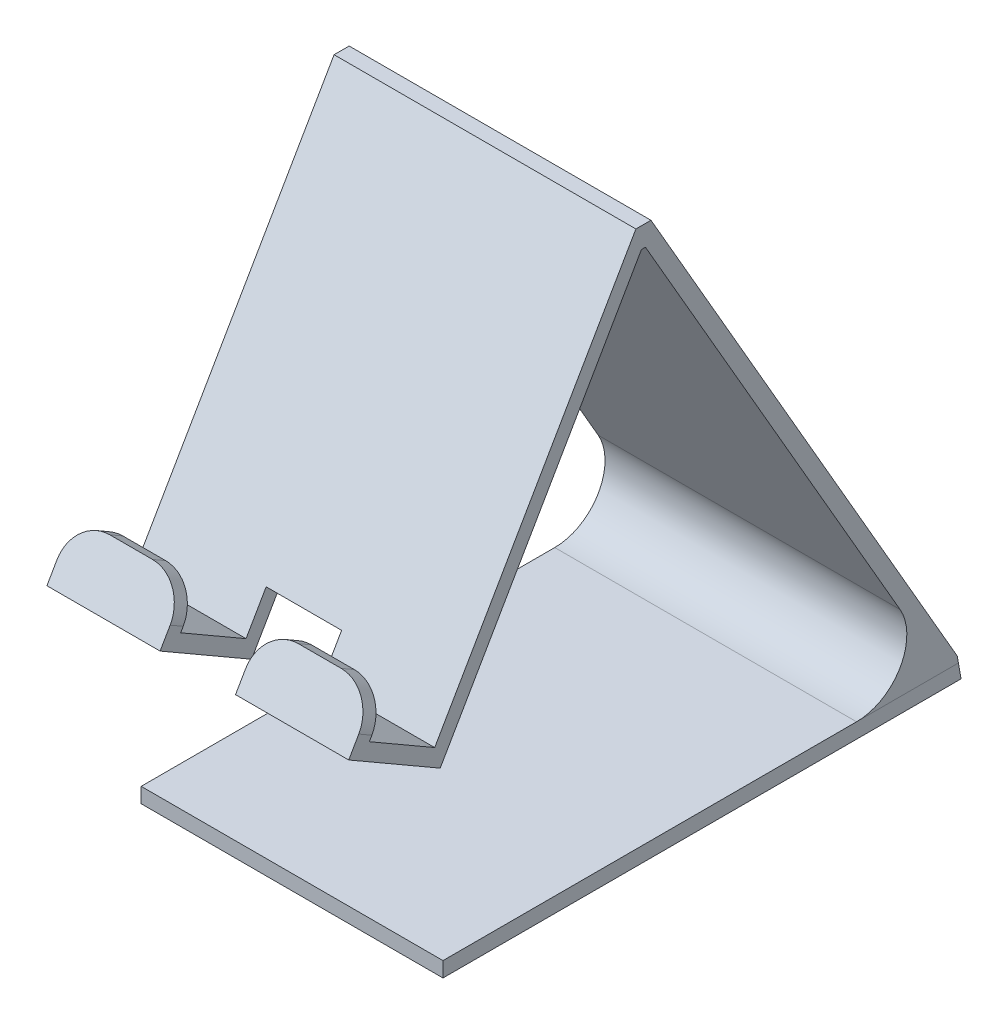
ISO-10303-21;
HEADER;
FILE_DESCRIPTION(('STEP AP214'),'2;1');
FILE_NAME('part.step','',(''),(''),'','','');
FILE_SCHEMA(('AUTOMOTIVE_DESIGN { 1 0 10303 214 1 1 1 1 }'));
ENDSEC;
DATA;
#1=APPLICATION_CONTEXT('core data for automotive mechanical design processes');
#2=APPLICATION_PROTOCOL_DEFINITION('international standard','automotive_design',2000,#1);
#3=PRODUCT_CONTEXT('',#1,'mechanical');
#4=PRODUCT('Part','Part','',(#3));
#5=PRODUCT_RELATED_PRODUCT_CATEGORY('part','',(#4));
#6=PRODUCT_DEFINITION_FORMATION('','',#4);
#7=PRODUCT_DEFINITION_CONTEXT('part definition',#1,'design');
#8=PRODUCT_DEFINITION('design','',#6,#7);
#9=PRODUCT_DEFINITION_SHAPE('','',#8);
#10=(LENGTH_UNIT() NAMED_UNIT(*) SI_UNIT(.MILLI.,.METRE.));
#11=(NAMED_UNIT(*) PLANE_ANGLE_UNIT() SI_UNIT($,.RADIAN.));
#12=(NAMED_UNIT(*) SI_UNIT($,.STERADIAN.) SOLID_ANGLE_UNIT());
#13=UNCERTAINTY_MEASURE_WITH_UNIT(LENGTH_MEASURE(1.E-05),#10,'distance_accuracy_value','');
#14=(GEOMETRIC_REPRESENTATION_CONTEXT(3) GLOBAL_UNCERTAINTY_ASSIGNED_CONTEXT((#13)) GLOBAL_UNIT_ASSIGNED_CONTEXT((#10,
#11,#12)) REPRESENTATION_CONTEXT('',''));
#15=CARTESIAN_POINT('',(0.,0.,0.));
#16=DIRECTION('',(0.,0.,1.));
#17=DIRECTION('',(1.,0.,0.));
#18=AXIS2_PLACEMENT_3D('',#15,#16,#17);
#19=CARTESIAN_POINT('',(-30.,49.5019123998392,68.7401964872934));
#20=DIRECTION('',(0.,0.866025403784394,-0.500000000000077));
#21=DIRECTION('',(0.,0.500000000000078,0.866025403784394));
#22=AXIS2_PLACEMENT_3D('',#19,#20,#21);
#23=PLANE('',#22);
#24=DIRECTION('',(0.,-0.500000000000077,-0.866025403784394));
#25=VECTOR('',#24,1.);
#26=CARTESIAN_POINT('',(7.5,49.5019123998392,68.7401964872934));
#27=LINE('',#26,#25);
#28=CARTESIAN_POINT('',(7.5,48.001912399839,66.1421202759403));
#29=VERTEX_POINT('',#28);
#30=CARTESIAN_POINT('',(7.50000000000002,40.5019123998389,53.1517392191735));
#31=VERTEX_POINT('',#30);
#32=EDGE_CURVE('E350',#29,#31,#27,.T.);
#33=ORIENTED_EDGE('',*,*,#32,.F.);
#34=DIRECTION('',(1.,0.,0.));
#35=VECTOR('',#34,1.);
#36=CARTESIAN_POINT('',(7.50000000000002,48.0019123998392,66.1421202759401));
#37=LINE('',#36,#35);
#38=CARTESIAN_POINT('',(30.,48.0019123998389,66.1421202759403));
#39=VERTEX_POINT('',#38);
#40=EDGE_CURVE('E341',#29,#39,#37,.T.);
#41=ORIENTED_EDGE('',*,*,#40,.T.);
#42=DIRECTION('',(0.,0.500000000000077,0.866025403784394));
#43=VECTOR('',#42,1.);
#44=CARTESIAN_POINT('',(30.,49.5019123998392,68.7401964872934));
#45=LINE('',#44,#43);
#46=CARTESIAN_POINT('',(30.,40.5019123998389,53.1517392191735));
#47=VERTEX_POINT('',#46);
#48=EDGE_CURVE('E394',#47,#39,#45,.T.);
#49=ORIENTED_EDGE('',*,*,#48,.F.);
#50=DIRECTION('',(1.,0.,0.));
#51=VECTOR('',#50,1.);
#52=CARTESIAN_POINT('',(-30.,40.5019123998389,53.1517392191735));
#53=LINE('',#52,#51);
#54=EDGE_CURVE('E417',#31,#47,#53,.T.);
#55=ORIENTED_EDGE('',*,*,#54,.F.);
#56=EDGE_LOOP('',(#33,#41,#49,#55));
#57=FACE_BOUND('',#56,.T.);
#58=ADVANCED_FACE('F48',(#57),#23,.T.);
#59=CARTESIAN_POINT('',(-30.,36.4038361884856,52.0536630078202));
#60=DIRECTION('',(0.,-0.866025403784439,0.5));
#61=DIRECTION('',(0.,-0.5,-0.866025403784439));
#62=AXIS2_PLACEMENT_3D('',#59,#60,#61);
#63=PLANE('',#62);
#64=DIRECTION('',(0.,0.500000000000002,0.866025403784437));
#65=VECTOR('',#64,1.);
#66=CARTESIAN_POINT('',(-7.50000000000001,23.4038361884857,29.5370025094248));
#67=LINE('',#66,#65);
#68=CARTESIAN_POINT('',(-7.5,36.4038361884858,52.0536630078201));
#69=VERTEX_POINT('',#68);
#70=CARTESIAN_POINT('',(-7.5,46.9038361884859,70.2401964872934));
#71=VERTEX_POINT('',#70);
#72=EDGE_CURVE('E356',#69,#71,#67,.T.);
#73=ORIENTED_EDGE('',*,*,#72,.T.);
#74=DIRECTION('',(1.,0.,0.));
#75=VECTOR('',#74,1.);
#76=CARTESIAN_POINT('',(-30.,46.9038361884859,70.2401964872934));
#77=LINE('',#76,#75);
#78=CARTESIAN_POINT('',(-30.,46.9038361884859,70.2401964872934));
#79=VERTEX_POINT('',#78);
#80=EDGE_CURVE('E411',#79,#71,#77,.T.);
#81=ORIENTED_EDGE('',*,*,#80,.F.);
#82=DIRECTION('',(0.,-0.500000000000006,-0.866025403784435));
#83=VECTOR('',#82,1.);
#84=CARTESIAN_POINT('',(-30.,46.9038361884859,70.2401964872934));
#85=LINE('',#84,#83);
#86=CARTESIAN_POINT('',(-30.,36.4038361884856,52.0536630078202));
#87=VERTEX_POINT('',#86);
#88=EDGE_CURVE('E381',#79,#87,#85,.T.);
#89=ORIENTED_EDGE('',*,*,#88,.T.);
#90=DIRECTION('',(1.,0.,0.));
#91=VECTOR('',#90,1.);
#92=CARTESIAN_POINT('',(-30.,36.4038361884856,52.0536630078202));
#93=LINE('',#92,#91);
#94=EDGE_CURVE('E407',#87,#69,#93,.T.);
#95=ORIENTED_EDGE('',*,*,#94,.T.);
#96=EDGE_LOOP('',(#73,#81,#89,#95));
#97=FACE_BOUND('',#96,.T.);
#98=ADVANCED_FACE('F514',(#97),#63,.T.);
#99=CARTESIAN_POINT('',(-30.,49.5019123998392,68.7401964872934));
#100=DIRECTION('',(0.,0.499999999999996,0.866025403784441));
#101=DIRECTION('',(0.,-0.866025403784441,0.499999999999996));
#102=AXIS2_PLACEMENT_3D('',#99,#100,#101);
#103=PLANE('',#102);
#104=DIRECTION('',(0.,-0.866025403784441,0.499999999999996));
#105=VECTOR('',#104,1.);
#106=CARTESIAN_POINT('',(-7.5,49.5019123998392,68.7401964872934));
#107=LINE('',#106,#105);
#108=CARTESIAN_POINT('',(-7.49999999999999,50.3679378036235,68.2401964872935));
#109=VERTEX_POINT('',#108);
#110=EDGE_CURVE('E333',#109,#71,#107,.T.);
#111=ORIENTED_EDGE('',*,*,#110,.F.);
#112=CARTESIAN_POINT('',(-14.5,50.3679378036235,68.2401964872935));
#113=DIRECTION('',(0.,0.499999999999996,0.866025403784441));
#114=DIRECTION('',(0.,-0.866025403784441,0.499999999999996));
#115=AXIS2_PLACEMENT_3D('',#112,#113,#114);
#116=CIRCLE('',#115,7.);
#117=CARTESIAN_POINT('',(-14.5,56.4301156301146,64.7401964872935));
#118=VERTEX_POINT('',#117);
#119=EDGE_CURVE('E297',#109,#118,#116,.T.);
#120=ORIENTED_EDGE('',*,*,#119,.T.);
#121=DIRECTION('',(-1.,0.,0.));
#122=VECTOR('',#121,1.);
#123=CARTESIAN_POINT('',(-30.,56.4301156301146,64.7401964872935));
#124=LINE('',#123,#122);
#125=CARTESIAN_POINT('',(-23.,56.4301156301146,64.7401964872935));
#126=VERTEX_POINT('',#125);
#127=EDGE_CURVE('E331',#118,#126,#124,.T.);
#128=ORIENTED_EDGE('',*,*,#127,.T.);
#129=CARTESIAN_POINT('',(-23.,50.3679378036235,68.2401964872935));
#130=DIRECTION('',(0.,0.499999999999996,0.866025403784441));
#131=DIRECTION('',(0.,-0.866025403784441,0.499999999999996));
#132=AXIS2_PLACEMENT_3D('',#129,#130,#131);
#133=CIRCLE('',#132,7.);
#134=CARTESIAN_POINT('',(-30.,50.3679378036235,68.2401964872935));
#135=VERTEX_POINT('',#134);
#136=EDGE_CURVE('E295',#126,#135,#133,.T.);
#137=ORIENTED_EDGE('',*,*,#136,.T.);
#138=DIRECTION('',(0.,-0.866025403784441,0.499999999999996));
#139=VECTOR('',#138,1.);
#140=CARTESIAN_POINT('',(-30.,49.5019123998392,68.7401964872934));
#141=LINE('',#140,#139);
#142=EDGE_CURVE('E379',#135,#79,#141,.T.);
#143=ORIENTED_EDGE('',*,*,#142,.T.);
#144=ORIENTED_EDGE('',*,*,#80,.T.);
#145=EDGE_LOOP('',(#111,#120,#128,#137,#143,#144));
#146=FACE_BOUND('',#145,.T.);
#147=ADVANCED_FACE('F330',(#146),#103,.T.);
#148=DIRECTION('',(1.,0.,0.));
#149=VECTOR('',#148,1.);
#150=CARTESIAN_POINT('',(-7.5,48.0019123998392,66.1421202759401));
#151=LINE('',#150,#149);
#152=CARTESIAN_POINT('',(-30.,48.0019123998389,66.1421202759403));
#153=VERTEX_POINT('',#152);
#154=CARTESIAN_POINT('',(-7.5,48.0019123998392,66.1421202759401));
#155=VERTEX_POINT('',#154);
#156=EDGE_CURVE('E324',#153,#155,#151,.T.);
#157=ORIENTED_EDGE('',*,*,#156,.T.);
#158=DIRECTION('',(0.,0.500000000000077,0.866025403784394));
#159=VECTOR('',#158,1.);
#160=CARTESIAN_POINT('',(-7.5,49.5019123998392,68.7401964872934));
#161=LINE('',#160,#159);
#162=CARTESIAN_POINT('',(-7.5,40.5019123998389,53.1517392191735));
#163=VERTEX_POINT('',#162);
#164=EDGE_CURVE('E323',#163,#155,#161,.T.);
#165=ORIENTED_EDGE('',*,*,#164,.F.);
#166=CARTESIAN_POINT('',(-30.,40.5019123998389,53.1517392191735));
#167=VERTEX_POINT('',#166);
#168=EDGE_CURVE('E414',#167,#163,#53,.T.);
#169=ORIENTED_EDGE('',*,*,#168,.F.);
#170=DIRECTION('',(0.,0.5,0.866025403784439));
#171=VECTOR('',#170,1.);
#172=CARTESIAN_POINT('',(-30.,40.5019123998389,53.1517392191735));
#173=LINE('',#172,#171);
#174=EDGE_CURVE('E376',#167,#153,#173,.T.);
#175=ORIENTED_EDGE('',*,*,#174,.T.);
#176=EDGE_LOOP('',(#157,#165,#169,#175));
#177=FACE_BOUND('',#176,.T.);
#178=ADVANCED_FACE('F442',(#177),#23,.T.);
#179=CARTESIAN_POINT('',(-30.,3.,-30.7153903091734));
#180=DIRECTION('',(0.,-1.,0.));
#181=DIRECTION('',(0.,0.,-1.));
#182=AXIS2_PLACEMENT_3D('',#179,#180,#181);
#183=PLANE('',#182);
#184=DIRECTION('',(-1.,0.,0.));
#185=VECTOR('',#184,1.);
#186=CARTESIAN_POINT('',(-30.,3.,-50.9710190578746));
#187=LINE('',#186,#185);
#188=CARTESIAN_POINT('',(30.,3.,-50.9710190578746));
#189=VERTEX_POINT('',#188);
#190=CARTESIAN_POINT('',(-30.,3.,-50.9710190578746));
#191=VERTEX_POINT('',#190);
#192=EDGE_CURVE('E221',#189,#191,#187,.T.);
#193=ORIENTED_EDGE('',*,*,#192,.F.);
#194=DIRECTION('',(0.,0.,-1.));
#195=VECTOR('',#194,1.);
#196=CARTESIAN_POINT('',(30.,3.,-30.7153903091734));
#197=LINE('',#196,#195);
#198=CARTESIAN_POINT('',(30.,3.,-30.7153903091734));
#199=VERTEX_POINT('',#198);
#200=EDGE_CURVE('E245',#199,#189,#197,.T.);
#201=ORIENTED_EDGE('',*,*,#200,.F.);
#202=DIRECTION('',(1.,0.,0.));
#203=VECTOR('',#202,1.);
#204=CARTESIAN_POINT('',(-30.,3.,-30.7153903091733));
#205=LINE('',#204,#203);
#206=CARTESIAN_POINT('',(-30.,3.,-30.7153903091733));
#207=VERTEX_POINT('',#206);
#208=EDGE_CURVE('E262',#207,#199,#205,.T.);
#209=ORIENTED_EDGE('',*,*,#208,.F.);
#210=DIRECTION('',(0.,0.,-1.));
#211=VECTOR('',#210,1.);
#212=CARTESIAN_POINT('',(-30.,3.,-48.0358983848622));
#213=LINE('',#212,#211);
#214=EDGE_CURVE('E240',#207,#191,#213,.T.);
#215=ORIENTED_EDGE('',*,*,#214,.T.);
#216=EDGE_LOOP('',(#193,#201,#209,#215));
#217=FACE_BOUND('',#216,.T.);
#218=ADVANCED_FACE('F502',(#217),#183,.T.);
#219=CARTESIAN_POINT('',(-30.,13.,-30.7153903091734));
#220=DIRECTION('',(1.,0.,0.));
#221=DIRECTION('',(0.,0.,-1.));
#222=AXIS2_PLACEMENT_3D('',#219,#220,#221);
#223=CYLINDRICAL_SURFACE('',#222,10.);
#224=CARTESIAN_POINT('',(30.,13.,-30.7153903091734));
#225=DIRECTION('',(-1.,0.,0.));
#226=DIRECTION('',(0.,0.,-1.));
#227=AXIS2_PLACEMENT_3D('',#224,#225,#226);
#228=CIRCLE('',#227,10.);
#229=CARTESIAN_POINT('',(30.,18.,-39.3756443470177));
#230=VERTEX_POINT('',#229);
#231=EDGE_CURVE('E257',#230,#199,#228,.T.);
#232=ORIENTED_EDGE('',*,*,#231,.F.);
#233=DIRECTION('',(1.,0.,0.));
#234=VECTOR('',#233,1.);
#235=CARTESIAN_POINT('',(-30.,18.,-39.3756443470177));
#236=LINE('',#235,#234);
#237=CARTESIAN_POINT('',(-30.,18.,-39.3756443470177));
#238=VERTEX_POINT('',#237);
#239=EDGE_CURVE('E265',#238,#230,#236,.T.);
#240=ORIENTED_EDGE('',*,*,#239,.F.);
#241=CARTESIAN_POINT('',(-30.,13.,-30.7153903091734));
#242=DIRECTION('',(-1.,0.,0.));
#243=DIRECTION('',(0.,0.,-1.));
#244=AXIS2_PLACEMENT_3D('',#241,#242,#243);
#245=CIRCLE('',#244,10.);
#246=EDGE_CURVE('E243',#238,#207,#245,.T.);
#247=ORIENTED_EDGE('',*,*,#246,.T.);
#248=ORIENTED_EDGE('',*,*,#208,.T.);
#249=EDGE_LOOP('',(#232,#240,#247,#248));
#250=FACE_BOUND('',#249,.T.);
#251=ADVANCED_FACE('F504',(#250),#223,.F.);
#252=CARTESIAN_POINT('',(-30.,18.,-39.3756443470177));
#253=DIRECTION('',(0.,-0.499999999999999,0.866025403784439));
#254=DIRECTION('',(0.,-0.866025403784439,-0.499999999999999));
#255=AXIS2_PLACEMENT_3D('',#252,#253,#254);
#256=PLANE('',#255);
#257=DIRECTION('',(0.,-0.866025403784439,-0.499999999999999));
#258=VECTOR('',#257,1.);
#259=CARTESIAN_POINT('',(30.,18.,-39.3756443470177));
#260=LINE('',#259,#258);
#261=CARTESIAN_POINT('',(30.,105.685868491241,11.2498154305262));
#262=VERTEX_POINT('',#261);
#263=EDGE_CURVE('E253',#262,#230,#260,.T.);
#264=ORIENTED_EDGE('',*,*,#263,.F.);
#265=DIRECTION('',(1.,0.,0.));
#266=VECTOR('',#265,1.);
#267=CARTESIAN_POINT('',(-30.,105.685868491241,11.2498154305262));
#268=LINE('',#267,#266);
#269=CARTESIAN_POINT('',(-30.,105.685868491241,11.2498154305262));
#270=VERTEX_POINT('',#269);
#271=EDGE_CURVE('E251',#270,#262,#268,.T.);
#272=ORIENTED_EDGE('',*,*,#271,.F.);
#273=DIRECTION('',(0.,-0.866025403784439,-0.499999999999999));
#274=VECTOR('',#273,1.);
#275=CARTESIAN_POINT('',(-30.,18.,-39.3756443470177));
#276=LINE('',#275,#274);
#277=EDGE_CURVE('E239',#270,#238,#276,.T.);
#278=ORIENTED_EDGE('',*,*,#277,.T.);
#279=ORIENTED_EDGE('',*,*,#239,.T.);
#280=EDGE_LOOP('',(#264,#272,#278,#279));
#281=FACE_BOUND('',#280,.T.);
#282=ADVANCED_FACE('F497',(#281),#256,.T.);
#283=CARTESIAN_POINT('',(-30.,3.,-51.5));
#284=DIRECTION('',(0.,0.500000000000004,-0.866025403784436));
#285=DIRECTION('',(0.,0.866025403784436,0.500000000000004));
#286=AXIS2_PLACEMENT_3D('',#283,#284,#285);
#287=PLANE('',#286);
#288=DIRECTION('',(1.,0.,0.));
#289=VECTOR('',#288,1.);
#290=CARTESIAN_POINT('',(-60.,4.31907786235776,-50.7384300410857));
#291=LINE('',#290,#289);
#292=CARTESIAN_POINT('',(-30.,4.31907786235776,-50.7384300410857));
#293=VERTEX_POINT('',#292);
#294=CARTESIAN_POINT('',(30.,4.31907786235776,-50.7384300410857));
#295=VERTEX_POINT('',#294);
#296=EDGE_CURVE('E63',#293,#295,#291,.T.);
#297=ORIENTED_EDGE('',*,*,#296,.F.);
#298=DIRECTION('',(0.,0.866025403784436,0.500000000000004));
#299=VECTOR('',#298,1.);
#300=CARTESIAN_POINT('',(-30.,3.,-51.5));
#301=LINE('',#300,#299);
#302=CARTESIAN_POINT('',(-30.,109.783944702594,10.1517392191734));
#303=VERTEX_POINT('',#302);
#304=EDGE_CURVE('E229',#293,#303,#301,.T.);
#305=ORIENTED_EDGE('',*,*,#304,.T.);
#306=DIRECTION('',(1.,0.,0.));
#307=VECTOR('',#306,1.);
#308=CARTESIAN_POINT('',(-30.,109.783944702594,10.1517392191734));
#309=LINE('',#308,#307);
#310=CARTESIAN_POINT('',(30.,109.783944702594,10.1517392191734));
#311=VERTEX_POINT('',#310);
#312=EDGE_CURVE('E388',#303,#311,#309,.T.);
#313=ORIENTED_EDGE('',*,*,#312,.T.);
#314=DIRECTION('',(0.,0.866025403784436,0.500000000000004));
#315=VECTOR('',#314,1.);
#316=CARTESIAN_POINT('',(30.,3.,-51.5));
#317=LINE('',#316,#315);
#318=EDGE_CURVE('E231',#295,#311,#317,.T.);
#319=ORIENTED_EDGE('',*,*,#318,.F.);
#320=EDGE_LOOP('',(#297,#305,#313,#319));
#321=FACE_BOUND('',#320,.T.);
#322=ADVANCED_FACE('F227',(#321),#287,.T.);
#323=CARTESIAN_POINT('',(-30.,13.,-30.7153903091734));
#324=DIRECTION('',(1.,0.,0.));
#325=DIRECTION('',(0.,0.,-1.));
#326=AXIS2_PLACEMENT_3D('',#323,#324,#325);
#327=PLANE('',#326);
#328=ORIENTED_EDGE('',*,*,#304,.F.);
#329=DIRECTION('',(0.,-0.984807753012207,-0.173648177666935));
#330=VECTOR('',#329,1.);
#331=CARTESIAN_POINT('',(-30.,16.1623796278208,-48.6501363991623));
#332=LINE('',#331,#330);
#333=EDGE_CURVE('E218',#293,#191,#332,.T.);
#334=ORIENTED_EDGE('',*,*,#333,.T.);
#335=ORIENTED_EDGE('',*,*,#214,.F.);
#336=ORIENTED_EDGE('',*,*,#246,.F.);
#337=ORIENTED_EDGE('',*,*,#277,.F.);
#338=DIRECTION('',(0.,3.62548264367736E-13,-1.));
#339=VECTOR('',#338,1.);
#340=CARTESIAN_POINT('',(-30.,105.685868491241,12.0536630078201));
#341=LINE('',#340,#339);
#342=CARTESIAN_POINT('',(-30.,105.685868491241,12.0536630078201));
#343=VERTEX_POINT('',#342);
#344=EDGE_CURVE('E386',#343,#270,#341,.T.);
#345=ORIENTED_EDGE('',*,*,#344,.F.);
#346=DIRECTION('',(0.,0.866025403784437,-0.500000000000002));
#347=VECTOR('',#346,1.);
#348=CARTESIAN_POINT('',(-30.,105.685868491241,12.0536630078201));
#349=LINE('',#348,#347);
#350=EDGE_CURVE('E383',#87,#343,#349,.T.);
#351=ORIENTED_EDGE('',*,*,#350,.F.);
#352=ORIENTED_EDGE('',*,*,#88,.F.);
#353=ORIENTED_EDGE('',*,*,#142,.F.);
#354=DIRECTION('',(0.,0.499999999999996,0.866025403784441));
#355=VECTOR('',#354,1.);
#356=CARTESIAN_POINT('',(-30.,48.8679378036236,65.6421202759402));
#357=LINE('',#356,#355);
#358=CARTESIAN_POINT('',(-30.,48.8679378036236,65.6421202759402));
#359=VERTEX_POINT('',#358);
#360=EDGE_CURVE('E12',#135,#359,#357,.F.);
#361=ORIENTED_EDGE('',*,*,#360,.T.);
#362=DIRECTION('',(0.,-0.866025403784441,0.499999999999996));
#363=VECTOR('',#362,1.);
#364=CARTESIAN_POINT('',(-30.,48.0019123998389,66.1421202759403));
#365=LINE('',#364,#363);
#366=EDGE_CURVE('E345',#359,#153,#365,.T.);
#367=ORIENTED_EDGE('',*,*,#366,.T.);
#368=ORIENTED_EDGE('',*,*,#174,.F.);
#369=DIRECTION('',(0.,-0.866025403784437,0.500000000000004));
#370=VECTOR('',#369,1.);
#371=CARTESIAN_POINT('',(-30.,107.185868491241,14.6517392191734));
#372=LINE('',#371,#370);
#373=CARTESIAN_POINT('',(-30.,109.783944702594,13.1517392191734));
#374=VERTEX_POINT('',#373);
#375=EDGE_CURVE('E373',#374,#167,#372,.T.);
#376=ORIENTED_EDGE('',*,*,#375,.F.);
#377=DIRECTION('',(0.,0.,1.));
#378=VECTOR('',#377,1.);
#379=CARTESIAN_POINT('',(-30.,109.783944702594,10.1517392191734));
#380=LINE('',#379,#378);
#381=EDGE_CURVE('E238',#303,#374,#380,.T.);
#382=ORIENTED_EDGE('',*,*,#381,.F.);
#383=EDGE_LOOP('',(#328,#334,#335,#336,#337,#345,#351,#352,#353,#361,#367,#368,#376,#382));
#384=FACE_BOUND('',#383,.T.);
#385=ADVANCED_FACE('F235',(#384),#327,.F.);
#386=CARTESIAN_POINT('',(30.,13.,-30.7153903091734));
#387=DIRECTION('',(1.,0.,0.));
#388=DIRECTION('',(0.,0.,-1.));
#389=AXIS2_PLACEMENT_3D('',#386,#387,#388);
#390=PLANE('',#389);
#391=DIRECTION('',(0.,-0.984807753012207,-0.173648177666935));
#392=VECTOR('',#391,1.);
#393=CARTESIAN_POINT('',(30.,0.,-51.5));
#394=LINE('',#393,#392);
#395=EDGE_CURVE('E232',#295,#189,#394,.T.);
#396=ORIENTED_EDGE('',*,*,#395,.F.);
#397=ORIENTED_EDGE('',*,*,#318,.T.);
#398=DIRECTION('',(0.,0.,1.));
#399=VECTOR('',#398,1.);
#400=CARTESIAN_POINT('',(30.,109.783944702594,10.1517392191734));
#401=LINE('',#400,#399);
#402=CARTESIAN_POINT('',(30.,109.783944702594,13.1517392191734));
#403=VERTEX_POINT('',#402);
#404=EDGE_CURVE('E371',#311,#403,#401,.T.);
#405=ORIENTED_EDGE('',*,*,#404,.T.);
#406=DIRECTION('',(0.,-0.866025403784437,0.500000000000002));
#407=VECTOR('',#406,1.);
#408=CARTESIAN_POINT('',(30.,107.185868491241,14.6517392191734));
#409=LINE('',#408,#407);
#410=EDGE_CURVE('E391',#403,#47,#409,.T.);
#411=ORIENTED_EDGE('',*,*,#410,.T.);
#412=ORIENTED_EDGE('',*,*,#48,.T.);
#413=DIRECTION('',(0.,0.866025403784441,-0.499999999999997));
#414=VECTOR('',#413,1.);
#415=CARTESIAN_POINT('',(30.,48.0019123998389,66.1421202759403));
#416=LINE('',#415,#414);
#417=CARTESIAN_POINT('',(30.,48.8679378036235,65.6421202759402));
#418=VERTEX_POINT('',#417);
#419=EDGE_CURVE('E337',#39,#418,#416,.T.);
#420=ORIENTED_EDGE('',*,*,#419,.T.);
#421=DIRECTION('',(0.,0.499999999999996,0.866025403784441));
#422=VECTOR('',#421,1.);
#423=CARTESIAN_POINT('',(30.,-1.82307265335012,-22.1572853225444));
#424=LINE('',#423,#422);
#425=CARTESIAN_POINT('',(30.,50.3679378036235,68.2401964872935));
#426=VERTEX_POINT('',#425);
#427=EDGE_CURVE('E274',#418,#426,#424,.T.);
#428=ORIENTED_EDGE('',*,*,#427,.T.);
#429=DIRECTION('',(0.,-0.866025403784441,0.499999999999996));
#430=VECTOR('',#429,1.);
#431=CARTESIAN_POINT('',(30.,49.5019123998392,68.7401964872934));
#432=LINE('',#431,#430);
#433=CARTESIAN_POINT('',(30.,46.9038361884859,70.2401964872934));
#434=VERTEX_POINT('',#433);
#435=EDGE_CURVE('E397',#426,#434,#432,.T.);
#436=ORIENTED_EDGE('',*,*,#435,.T.);
#437=DIRECTION('',(0.,-0.5,-0.866025403784439));
#438=VECTOR('',#437,1.);
#439=CARTESIAN_POINT('',(30.,36.4038361884856,52.0536630078202));
#440=LINE('',#439,#438);
#441=CARTESIAN_POINT('',(30.,36.4038361884856,52.0536630078202));
#442=VERTEX_POINT('',#441);
#443=EDGE_CURVE('E399',#434,#442,#440,.T.);
#444=ORIENTED_EDGE('',*,*,#443,.T.);
#445=DIRECTION('',(0.,0.866025403784437,-0.500000000000002));
#446=VECTOR('',#445,1.);
#447=CARTESIAN_POINT('',(30.,105.685868491241,12.0536630078201));
#448=LINE('',#447,#446);
#449=CARTESIAN_POINT('',(30.,105.685868491241,12.0536630078201));
#450=VERTEX_POINT('',#449);
#451=EDGE_CURVE('E402',#442,#450,#448,.T.);
#452=ORIENTED_EDGE('',*,*,#451,.T.);
#453=DIRECTION('',(0.,3.62548264367736E-13,-1.));
#454=VECTOR('',#453,1.);
#455=CARTESIAN_POINT('',(30.,105.685868491241,12.0536630078201));
#456=LINE('',#455,#454);
#457=EDGE_CURVE('E374',#450,#262,#456,.T.);
#458=ORIENTED_EDGE('',*,*,#457,.T.);
#459=ORIENTED_EDGE('',*,*,#263,.T.);
#460=ORIENTED_EDGE('',*,*,#231,.T.);
#461=ORIENTED_EDGE('',*,*,#200,.T.);
#462=EDGE_LOOP('',(#396,#397,#405,#411,#412,#420,#428,#436,#444,#452,#458,#459,#460,#461));
#463=FACE_BOUND('',#462,.T.);
#464=ADVANCED_FACE('F424',(#463),#390,.T.);
#465=CARTESIAN_POINT('',(-30.,105.685868491241,12.0536630078201));
#466=DIRECTION('',(0.,-1.,-3.62548264367736E-13));
#467=DIRECTION('',(0.,3.62548264367736E-13,-1.));
#468=AXIS2_PLACEMENT_3D('',#465,#466,#467);
#469=PLANE('',#468);
#470=ORIENTED_EDGE('',*,*,#457,.F.);
#471=DIRECTION('',(1.,0.,0.));
#472=VECTOR('',#471,1.);
#473=CARTESIAN_POINT('',(-30.,105.685868491241,12.0536630078201));
#474=LINE('',#473,#472);
#475=EDGE_CURVE('E254',#343,#450,#474,.T.);
#476=ORIENTED_EDGE('',*,*,#475,.F.);
#477=ORIENTED_EDGE('',*,*,#344,.T.);
#478=ORIENTED_EDGE('',*,*,#271,.T.);
#479=EDGE_LOOP('',(#470,#476,#477,#478));
#480=FACE_BOUND('',#479,.T.);
#481=ADVANCED_FACE('F491',(#480),#469,.T.);
#482=CARTESIAN_POINT('',(-30.,105.685868491241,12.0536630078201));
#483=DIRECTION('',(0.,-0.500000000000002,-0.866025403784437));
#484=DIRECTION('',(0.,0.866025403784437,-0.500000000000002));
#485=AXIS2_PLACEMENT_3D('',#482,#483,#484);
#486=PLANE('',#485);
#487=DIRECTION('',(0.,0.866025403784438,-0.500000000000002));
#488=VECTOR('',#487,1.);
#489=CARTESIAN_POINT('',(-7.49999999999989,105.685868491241,12.0536630078201));
#490=LINE('',#489,#488);
#491=CARTESIAN_POINT('',(-7.49999999999999,45.9301156301146,46.5536630078201));
#492=VERTEX_POINT('',#491);
#493=EDGE_CURVE('E369',#69,#492,#490,.T.);
#494=ORIENTED_EDGE('',*,*,#493,.F.);
#495=ORIENTED_EDGE('',*,*,#94,.F.);
#496=ORIENTED_EDGE('',*,*,#350,.T.);
#497=ORIENTED_EDGE('',*,*,#475,.T.);
#498=ORIENTED_EDGE('',*,*,#451,.F.);
#499=CARTESIAN_POINT('',(7.49999999999999,36.4038361884858,52.0536630078201));
#500=VERTEX_POINT('',#499);
#501=EDGE_CURVE('E410',#500,#442,#93,.T.);
#502=ORIENTED_EDGE('',*,*,#501,.F.);
#503=DIRECTION('',(0.,-0.866025403784438,0.500000000000002));
#504=VECTOR('',#503,1.);
#505=CARTESIAN_POINT('',(7.50000000000012,105.685868491241,12.0536630078201));
#506=LINE('',#505,#504);
#507=CARTESIAN_POINT('',(7.50000000000001,45.9301156301146,46.5536630078201));
#508=VERTEX_POINT('',#507);
#509=EDGE_CURVE('E363',#508,#500,#506,.T.);
#510=ORIENTED_EDGE('',*,*,#509,.F.);
#511=DIRECTION('',(1.,0.,0.));
#512=VECTOR('',#511,1.);
#513=CARTESIAN_POINT('',(-30.,45.9301156301146,46.5536630078201));
#514=LINE('',#513,#512);
#515=EDGE_CURVE('E365',#492,#508,#514,.T.);
#516=ORIENTED_EDGE('',*,*,#515,.F.);
#517=EDGE_LOOP('',(#494,#495,#496,#497,#498,#502,#510,#516));
#518=FACE_BOUND('',#517,.T.);
#519=ADVANCED_FACE('F487',(#518),#486,.T.);
#520=DIRECTION('',(0.,0.500000000000002,0.866025403784437));
#521=VECTOR('',#520,1.);
#522=CARTESIAN_POINT('',(7.49999999999999,23.4038361884857,29.5370025094248));
#523=LINE('',#522,#521);
#524=CARTESIAN_POINT('',(7.5,46.9038361884859,70.2401964872934));
#525=VERTEX_POINT('',#524);
#526=EDGE_CURVE('E354',#500,#525,#523,.T.);
#527=ORIENTED_EDGE('',*,*,#526,.F.);
#528=ORIENTED_EDGE('',*,*,#501,.T.);
#529=ORIENTED_EDGE('',*,*,#443,.F.);
#530=EDGE_CURVE('E413',#525,#434,#77,.T.);
#531=ORIENTED_EDGE('',*,*,#530,.F.);
#532=EDGE_LOOP('',(#527,#528,#529,#531));
#533=FACE_BOUND('',#532,.T.);
#534=ADVANCED_FACE('F482',(#533),#63,.T.);
#535=ORIENTED_EDGE('',*,*,#435,.F.);
#536=CARTESIAN_POINT('',(23.,50.3679378036235,68.2401964872935));
#537=DIRECTION('',(0.,0.499999999999996,0.866025403784441));
#538=DIRECTION('',(0.,-0.866025403784441,0.499999999999996));
#539=AXIS2_PLACEMENT_3D('',#536,#537,#538);
#540=CIRCLE('',#539,7.);
#541=CARTESIAN_POINT('',(23.,56.4301156301146,64.7401964872935));
#542=VERTEX_POINT('',#541);
#543=EDGE_CURVE('E279',#426,#542,#540,.T.);
#544=ORIENTED_EDGE('',*,*,#543,.T.);
#545=DIRECTION('',(-1.,0.,0.));
#546=VECTOR('',#545,1.);
#547=CARTESIAN_POINT('',(30.,56.4301156301146,64.7401964872935));
#548=LINE('',#547,#546);
#549=CARTESIAN_POINT('',(14.5,56.4301156301146,64.7401964872935));
#550=VERTEX_POINT('',#549);
#551=EDGE_CURVE('E429',#542,#550,#548,.T.);
#552=ORIENTED_EDGE('',*,*,#551,.T.);
#553=CARTESIAN_POINT('',(14.5,50.3679378036235,68.2401964872935));
#554=DIRECTION('',(0.,0.499999999999996,0.866025403784441));
#555=DIRECTION('',(0.,-0.866025403784441,0.499999999999996));
#556=AXIS2_PLACEMENT_3D('',#553,#554,#555);
#557=CIRCLE('',#556,7.);
#558=CARTESIAN_POINT('',(7.5,50.3679378036235,68.2401964872935));
#559=VERTEX_POINT('',#558);
#560=EDGE_CURVE('E277',#550,#559,#557,.T.);
#561=ORIENTED_EDGE('',*,*,#560,.T.);
#562=DIRECTION('',(0.,0.866025403784441,-0.499999999999996));
#563=VECTOR('',#562,1.);
#564=CARTESIAN_POINT('',(7.5,49.5019123998391,68.7401964872934));
#565=LINE('',#564,#563);
#566=EDGE_CURVE('E360',#525,#559,#565,.T.);
#567=ORIENTED_EDGE('',*,*,#566,.F.);
#568=ORIENTED_EDGE('',*,*,#530,.T.);
#569=EDGE_LOOP('',(#535,#544,#552,#561,#567,#568));
#570=FACE_BOUND('',#569,.T.);
#571=ADVANCED_FACE('F462',(#570),#103,.T.);
#572=CARTESIAN_POINT('',(-30.,107.185868491241,14.6517392191734));
#573=DIRECTION('',(0.,0.500000000000002,0.866025403784437));
#574=DIRECTION('',(0.,-0.866025403784437,0.500000000000002));
#575=AXIS2_PLACEMENT_3D('',#572,#573,#574);
#576=PLANE('',#575);
#577=DIRECTION('',(0.,-0.866025403784438,0.500000000000002));
#578=VECTOR('',#577,1.);
#579=CARTESIAN_POINT('',(-7.49999999999989,107.185868491241,14.6517392191734));
#580=LINE('',#579,#578);
#581=CARTESIAN_POINT('',(-7.49999999999999,47.4301156301146,49.1517392191734));
#582=VERTEX_POINT('',#581);
#583=EDGE_CURVE('E272',#582,#163,#580,.T.);
#584=ORIENTED_EDGE('',*,*,#583,.F.);
#585=DIRECTION('',(-1.,0.,0.));
#586=VECTOR('',#585,1.);
#587=CARTESIAN_POINT('',(-30.,47.4301156301146,49.1517392191734));
#588=LINE('',#587,#586);
#589=CARTESIAN_POINT('',(7.50000000000001,47.4301156301146,49.1517392191734));
#590=VERTEX_POINT('',#589);
#591=EDGE_CURVE('E270',#590,#582,#588,.T.);
#592=ORIENTED_EDGE('',*,*,#591,.F.);
#593=DIRECTION('',(0.,0.866025403784438,-0.500000000000002));
#594=VECTOR('',#593,1.);
#595=CARTESIAN_POINT('',(7.50000000000012,107.185868491241,14.6517392191734));
#596=LINE('',#595,#594);
#597=EDGE_CURVE('E264',#31,#590,#596,.T.);
#598=ORIENTED_EDGE('',*,*,#597,.F.);
#599=ORIENTED_EDGE('',*,*,#54,.T.);
#600=ORIENTED_EDGE('',*,*,#410,.F.);
#601=DIRECTION('',(1.,0.,0.));
#602=VECTOR('',#601,1.);
#603=CARTESIAN_POINT('',(-30.,109.783944702594,13.1517392191734));
#604=LINE('',#603,#602);
#605=EDGE_CURVE('E418',#374,#403,#604,.T.);
#606=ORIENTED_EDGE('',*,*,#605,.F.);
#607=ORIENTED_EDGE('',*,*,#375,.T.);
#608=ORIENTED_EDGE('',*,*,#168,.T.);
#609=EDGE_LOOP('',(#584,#592,#598,#599,#600,#606,#607,#608));
#610=FACE_BOUND('',#609,.T.);
#611=ADVANCED_FACE('F445',(#610),#576,.T.);
#612=CARTESIAN_POINT('',(-30.,109.783944702594,10.1517392191734));
#613=DIRECTION('',(0.,1.,0.));
#614=DIRECTION('',(0.,0.,1.));
#615=AXIS2_PLACEMENT_3D('',#612,#613,#614);
#616=PLANE('',#615);
#617=ORIENTED_EDGE('',*,*,#404,.F.);
#618=ORIENTED_EDGE('',*,*,#312,.F.);
#619=ORIENTED_EDGE('',*,*,#381,.T.);
#620=ORIENTED_EDGE('',*,*,#605,.T.);
#621=EDGE_LOOP('',(#617,#618,#619,#620));
#622=FACE_BOUND('',#621,.T.);
#623=ADVANCED_FACE('F422',(#622),#616,.T.);
#624=CARTESIAN_POINT('',(-7.49999999999999,32.9301156301145,24.0370025094247));
#625=DIRECTION('',(-1.,0.,0.));
#626=DIRECTION('',(0.,-1.,0.));
#627=AXIS2_PLACEMENT_3D('',#624,#625,#626);
#628=PLANE('',#627);
#629=DIRECTION('',(0.,0.866025403784441,-0.499999999999996));
#630=VECTOR('',#629,1.);
#631=CARTESIAN_POINT('',(-7.49999999999999,54.9301156301146,62.1421202759402));
#632=LINE('',#631,#630);
#633=CARTESIAN_POINT('',(-7.49999999999999,48.8679378036236,65.6421202759402));
#634=VERTEX_POINT('',#633);
#635=EDGE_CURVE('E311',#155,#634,#632,.T.);
#636=ORIENTED_EDGE('',*,*,#635,.T.);
#637=DIRECTION('',(0.,0.499999999999996,0.866025403784441));
#638=VECTOR('',#637,1.);
#639=CARTESIAN_POINT('',(-7.5,50.3679378036235,68.2401964872935));
#640=LINE('',#639,#638);
#641=EDGE_CURVE('E292',#634,#109,#640,.T.);
#642=ORIENTED_EDGE('',*,*,#641,.T.);
#643=ORIENTED_EDGE('',*,*,#110,.T.);
#644=ORIENTED_EDGE('',*,*,#72,.F.);
#645=ORIENTED_EDGE('',*,*,#493,.T.);
#646=DIRECTION('',(0.,0.500000000000002,0.866025403784437));
#647=VECTOR('',#646,1.);
#648=CARTESIAN_POINT('',(-7.49999999999999,32.9301156301145,24.0370025094247));
#649=LINE('',#648,#647);
#650=EDGE_CURVE('E347',#492,#582,#649,.T.);
#651=ORIENTED_EDGE('',*,*,#650,.T.);
#652=ORIENTED_EDGE('',*,*,#583,.T.);
#653=ORIENTED_EDGE('',*,*,#164,.T.);
#654=EDGE_LOOP('',(#636,#642,#643,#644,#645,#651,#652,#653));
#655=FACE_BOUND('',#654,.T.);
#656=ADVANCED_FACE('F320',(#655),#628,.F.);
#657=CARTESIAN_POINT('',(-7.49999999999999,32.9301156301145,24.0370025094247));
#658=DIRECTION('',(0.,0.866025403784437,-0.500000000000002));
#659=DIRECTION('',(0.,0.500000000000002,0.866025403784437));
#660=AXIS2_PLACEMENT_3D('',#657,#658,#659);
#661=PLANE('',#660);
#662=ORIENTED_EDGE('',*,*,#515,.T.);
#663=DIRECTION('',(0.,0.500000000000002,0.866025403784437));
#664=VECTOR('',#663,1.);
#665=CARTESIAN_POINT('',(7.50000000000001,32.9301156301145,24.0370025094247));
#666=LINE('',#665,#664);
#667=EDGE_CURVE('E351',#508,#590,#666,.T.);
#668=ORIENTED_EDGE('',*,*,#667,.T.);
#669=ORIENTED_EDGE('',*,*,#591,.T.);
#670=ORIENTED_EDGE('',*,*,#650,.F.);
#671=EDGE_LOOP('',(#662,#668,#669,#670));
#672=FACE_BOUND('',#671,.T.);
#673=ADVANCED_FACE('F543',(#672),#661,.F.);
#674=CARTESIAN_POINT('',(7.50000000000001,32.9301156301145,24.0370025094247));
#675=DIRECTION('',(1.,0.,0.));
#676=DIRECTION('',(0.,1.,0.));
#677=AXIS2_PLACEMENT_3D('',#674,#675,#676);
#678=PLANE('',#677);
#679=ORIENTED_EDGE('',*,*,#566,.T.);
#680=DIRECTION('',(0.,0.499999999999996,0.866025403784441));
#681=VECTOR('',#680,1.);
#682=CARTESIAN_POINT('',(7.5,48.8679378036235,65.6421202759402));
#683=LINE('',#682,#681);
#684=CARTESIAN_POINT('',(7.50000000000002,48.8679378036235,65.6421202759402));
#685=VERTEX_POINT('',#684);
#686=EDGE_CURVE('E290',#559,#685,#683,.F.);
#687=ORIENTED_EDGE('',*,*,#686,.T.);
#688=DIRECTION('',(0.,-0.866025403784441,0.499999999999996));
#689=VECTOR('',#688,1.);
#690=CARTESIAN_POINT('',(7.50000000000002,54.9301156301146,62.1421202759402));
#691=LINE('',#690,#689);
#692=EDGE_CURVE('E433',#685,#29,#691,.T.);
#693=ORIENTED_EDGE('',*,*,#692,.T.);
#694=ORIENTED_EDGE('',*,*,#32,.T.);
#695=ORIENTED_EDGE('',*,*,#597,.T.);
#696=ORIENTED_EDGE('',*,*,#667,.F.);
#697=ORIENTED_EDGE('',*,*,#509,.T.);
#698=ORIENTED_EDGE('',*,*,#526,.T.);
#699=EDGE_LOOP('',(#679,#687,#693,#694,#695,#696,#697,#698));
#700=FACE_BOUND('',#699,.T.);
#701=ADVANCED_FACE('F475',(#700),#678,.F.);
#702=CARTESIAN_POINT('',(-30.,54.9301156301146,62.1421202759402));
#703=DIRECTION('',(0.,0.866025403784441,-0.499999999999996));
#704=DIRECTION('',(0.,0.499999999999996,0.866025403784441));
#705=AXIS2_PLACEMENT_3D('',#702,#703,#704);
#706=PLANE('',#705);
#707=ORIENTED_EDGE('',*,*,#127,.F.);
#708=DIRECTION('',(0.,0.499999999999996,0.866025403784441));
#709=VECTOR('',#708,1.);
#710=CARTESIAN_POINT('',(-14.5,54.9301156301146,62.1421202759402));
#711=LINE('',#710,#709);
#712=CARTESIAN_POINT('',(-14.5,54.9301156301146,62.1421202759402));
#713=VERTEX_POINT('',#712);
#714=EDGE_CURVE('E302',#118,#713,#711,.F.);
#715=ORIENTED_EDGE('',*,*,#714,.T.);
#716=DIRECTION('',(-1.,0.,0.));
#717=VECTOR('',#716,1.);
#718=CARTESIAN_POINT('',(-30.,54.9301156301146,62.1421202759402));
#719=LINE('',#718,#717);
#720=CARTESIAN_POINT('',(-23.,54.9301156301146,62.1421202759402));
#721=VERTEX_POINT('',#720);
#722=EDGE_CURVE('E314',#713,#721,#719,.T.);
#723=ORIENTED_EDGE('',*,*,#722,.T.);
#724=DIRECTION('',(0.,0.499999999999996,0.866025403784441));
#725=VECTOR('',#724,1.);
#726=CARTESIAN_POINT('',(-23.,56.4301156301146,64.7401964872935));
#727=LINE('',#726,#725);
#728=EDGE_CURVE('E299',#721,#126,#727,.T.);
#729=ORIENTED_EDGE('',*,*,#728,.T.);
#730=EDGE_LOOP('',(#707,#715,#723,#729));
#731=FACE_BOUND('',#730,.T.);
#732=ADVANCED_FACE('F335',(#731),#706,.T.);
#733=CARTESIAN_POINT('',(0.,40.6408563095245,70.3920279912032));
#734=DIRECTION('',(0.,-0.499999999999996,-0.866025403784441));
#735=DIRECTION('',(0.,0.866025403784441,-0.499999999999996));
#736=AXIS2_PLACEMENT_3D('',#733,#734,#735);
#737=PLANE('',#736);
#738=ORIENTED_EDGE('',*,*,#722,.F.);
#739=CARTESIAN_POINT('',(-14.5,48.8679378036236,65.6421202759402));
#740=DIRECTION('',(0.,-0.499999999999996,-0.866025403784441));
#741=DIRECTION('',(0.,0.866025403784441,-0.499999999999996));
#742=AXIS2_PLACEMENT_3D('',#739,#740,#741);
#743=CIRCLE('',#742,7.);
#744=EDGE_CURVE('E56',#713,#634,#743,.T.);
#745=ORIENTED_EDGE('',*,*,#744,.T.);
#746=ORIENTED_EDGE('',*,*,#635,.F.);
#747=ORIENTED_EDGE('',*,*,#156,.F.);
#748=ORIENTED_EDGE('',*,*,#366,.F.);
#749=CARTESIAN_POINT('',(-23.,48.8679378036236,65.6421202759402));
#750=DIRECTION('',(0.,-0.499999999999996,-0.866025403784441));
#751=DIRECTION('',(0.,0.866025403784441,-0.499999999999996));
#752=AXIS2_PLACEMENT_3D('',#749,#750,#751);
#753=CIRCLE('',#752,7.);
#754=EDGE_CURVE('E304',#359,#721,#753,.T.);
#755=ORIENTED_EDGE('',*,*,#754,.T.);
#756=EDGE_LOOP('',(#738,#745,#746,#747,#748,#755));
#757=FACE_BOUND('',#756,.T.);
#758=ADVANCED_FACE('F309',(#757),#737,.T.);
#759=CARTESIAN_POINT('',(30.,54.9301156301146,62.1421202759402));
#760=DIRECTION('',(0.,0.866025403784441,-0.499999999999996));
#761=DIRECTION('',(0.,0.499999999999996,0.866025403784441));
#762=AXIS2_PLACEMENT_3D('',#759,#760,#761);
#763=PLANE('',#762);
#764=ORIENTED_EDGE('',*,*,#551,.F.);
#765=DIRECTION('',(0.,0.499999999999996,0.866025403784441));
#766=VECTOR('',#765,1.);
#767=CARTESIAN_POINT('',(23.,54.9301156301146,62.1421202759402));
#768=LINE('',#767,#766);
#769=CARTESIAN_POINT('',(23.,54.9301156301146,62.1421202759402));
#770=VERTEX_POINT('',#769);
#771=EDGE_CURVE('E284',#542,#770,#768,.F.);
#772=ORIENTED_EDGE('',*,*,#771,.T.);
#773=DIRECTION('',(-1.,0.,0.));
#774=VECTOR('',#773,1.);
#775=CARTESIAN_POINT('',(30.,54.9301156301146,62.1421202759402));
#776=LINE('',#775,#774);
#777=CARTESIAN_POINT('',(14.5,54.9301156301146,62.1421202759402));
#778=VERTEX_POINT('',#777);
#779=EDGE_CURVE('E430',#770,#778,#776,.T.);
#780=ORIENTED_EDGE('',*,*,#779,.T.);
#781=DIRECTION('',(0.,0.499999999999996,0.866025403784441));
#782=VECTOR('',#781,1.);
#783=CARTESIAN_POINT('',(14.5,56.4301156301146,64.7401964872935));
#784=LINE('',#783,#782);
#785=EDGE_CURVE('E281',#778,#550,#784,.T.);
#786=ORIENTED_EDGE('',*,*,#785,.T.);
#787=EDGE_LOOP('',(#764,#772,#780,#786));
#788=FACE_BOUND('',#787,.T.);
#789=ADVANCED_FACE('F465',(#788),#763,.T.);
#790=CARTESIAN_POINT('',(0.,40.6408563095244,70.3920279912032));
#791=DIRECTION('',(0.,0.499999999999996,0.866025403784441));
#792=DIRECTION('',(0.,-0.866025403784441,0.499999999999996));
#793=AXIS2_PLACEMENT_3D('',#790,#791,#792);
#794=PLANE('',#793);
#795=ORIENTED_EDGE('',*,*,#779,.F.);
#796=CARTESIAN_POINT('',(23.,48.8679378036235,65.6421202759402));
#797=DIRECTION('',(0.,0.499999999999996,0.866025403784441));
#798=DIRECTION('',(0.,-0.866025403784441,0.499999999999996));
#799=AXIS2_PLACEMENT_3D('',#796,#797,#798);
#800=CIRCLE('',#799,7.);
#801=EDGE_CURVE('E288',#770,#418,#800,.F.);
#802=ORIENTED_EDGE('',*,*,#801,.T.);
#803=ORIENTED_EDGE('',*,*,#419,.F.);
#804=ORIENTED_EDGE('',*,*,#40,.F.);
#805=ORIENTED_EDGE('',*,*,#692,.F.);
#806=CARTESIAN_POINT('',(14.5,48.8679378036235,65.6421202759402));
#807=DIRECTION('',(0.,0.499999999999996,0.866025403784441));
#808=DIRECTION('',(0.,-0.866025403784441,0.499999999999996));
#809=AXIS2_PLACEMENT_3D('',#806,#807,#808);
#810=CIRCLE('',#809,7.);
#811=EDGE_CURVE('E286',#685,#778,#810,.F.);
#812=ORIENTED_EDGE('',*,*,#811,.T.);
#813=EDGE_LOOP('',(#795,#802,#803,#804,#805,#812));
#814=FACE_BOUND('',#813,.T.);
#815=ADVANCED_FACE('F555',(#814),#794,.F.);
#816=CARTESIAN_POINT('',(23.,-1.82307265335012,-22.1572853225444));
#817=DIRECTION('',(0.,0.499999999999996,0.866025403784441));
#818=DIRECTION('',(0.,-0.866025403784441,0.499999999999996));
#819=AXIS2_PLACEMENT_3D('',#816,#817,#818);
#820=CYLINDRICAL_SURFACE('',#819,7.);
#821=ORIENTED_EDGE('',*,*,#801,.F.);
#822=ORIENTED_EDGE('',*,*,#771,.F.);
#823=ORIENTED_EDGE('',*,*,#543,.F.);
#824=ORIENTED_EDGE('',*,*,#427,.F.);
#825=EDGE_LOOP('',(#821,#822,#823,#824));
#826=FACE_BOUND('',#825,.T.);
#827=ADVANCED_FACE('F458',(#826),#820,.T.);
#828=CARTESIAN_POINT('',(14.5,48.8679378036235,65.6421202759402));
#829=DIRECTION('',(0.,-0.499999999999996,-0.866025403784441));
#830=DIRECTION('',(0.,0.866025403784441,-0.499999999999996));
#831=AXIS2_PLACEMENT_3D('',#828,#829,#830);
#832=CYLINDRICAL_SURFACE('',#831,7.);
#833=ORIENTED_EDGE('',*,*,#811,.F.);
#834=ORIENTED_EDGE('',*,*,#686,.F.);
#835=ORIENTED_EDGE('',*,*,#560,.F.);
#836=ORIENTED_EDGE('',*,*,#785,.F.);
#837=EDGE_LOOP('',(#833,#834,#835,#836));
#838=FACE_BOUND('',#837,.T.);
#839=ADVANCED_FACE('F470',(#838),#832,.T.);
#840=CARTESIAN_POINT('',(-14.5,26.8679378036236,27.5370025094246));
#841=DIRECTION('',(0.,-0.499999999999996,-0.866025403784441));
#842=DIRECTION('',(0.,0.866025403784441,-0.499999999999996));
#843=AXIS2_PLACEMENT_3D('',#840,#841,#842);
#844=CYLINDRICAL_SURFACE('',#843,7.);
#845=ORIENTED_EDGE('',*,*,#744,.F.);
#846=ORIENTED_EDGE('',*,*,#714,.F.);
#847=ORIENTED_EDGE('',*,*,#119,.F.);
#848=ORIENTED_EDGE('',*,*,#641,.F.);
#849=EDGE_LOOP('',(#845,#846,#847,#848));
#850=FACE_BOUND('',#849,.T.);
#851=ADVANCED_FACE('F326',(#850),#844,.T.);
#852=CARTESIAN_POINT('',(-23.,48.8679378036236,65.6421202759402));
#853=DIRECTION('',(0.,-0.499999999999996,-0.866025403784441));
#854=DIRECTION('',(0.,0.866025403784441,-0.499999999999996));
#855=AXIS2_PLACEMENT_3D('',#852,#853,#854);
#856=CYLINDRICAL_SURFACE('',#855,7.);
#857=ORIENTED_EDGE('',*,*,#754,.F.);
#858=ORIENTED_EDGE('',*,*,#360,.F.);
#859=ORIENTED_EDGE('',*,*,#136,.F.);
#860=ORIENTED_EDGE('',*,*,#728,.F.);
#861=EDGE_LOOP('',(#857,#858,#859,#860));
#862=FACE_BOUND('',#861,.T.);
#863=ADVANCED_FACE('F50',(#862),#856,.T.);
#864=CARTESIAN_POINT('',(-60.,0.,-51.5));
#865=DIRECTION('',(0.,-0.173648177666935,0.984807753012207));
#866=DIRECTION('',(0.,-0.984807753012207,-0.173648177666935));
#867=AXIS2_PLACEMENT_3D('',#864,#865,#866);
#868=PLANE('',#867);
#869=ORIENTED_EDGE('',*,*,#192,.T.);
#870=ORIENTED_EDGE('',*,*,#333,.F.);
#871=ORIENTED_EDGE('',*,*,#296,.T.);
#872=ORIENTED_EDGE('',*,*,#395,.T.);
#873=EDGE_LOOP('',(#869,#870,#871,#872));
#874=FACE_BOUND('',#873,.T.);
#875=ADVANCED_FACE('F219',(#874),#868,.F.);
#876=CLOSED_SHELL('',(#58,#98,#147,#178,#218,#251,#282,#322,#385,#464,#481,#519,#534,#571,#611,
#623,#656,#673,#701,#732,#758,#789,#815,#827,#839,#851,#863,#875));
#877=MANIFOLD_SOLID_BREP('B2',#876);
#878=CARTESIAN_POINT('',(30.,3.,-51.5));
#879=DIRECTION('',(-1.,0.,0.));
#880=DIRECTION('',(0.,0.,1.));
#881=AXIS2_PLACEMENT_3D('',#878,#879,#880);
#882=PLANE('',#881);
#883=DIRECTION('',(0.,0.,-1.));
#884=VECTOR('',#883,1.);
#885=CARTESIAN_POINT('',(30.,0.,-51.5));
#886=LINE('',#885,#884);
#887=CARTESIAN_POINT('',(30.,0.,51.5));
#888=VERTEX_POINT('',#887);
#889=CARTESIAN_POINT('',(30.,0.,-51.5));
#890=VERTEX_POINT('',#889);
#891=EDGE_CURVE('E865',#888,#890,#886,.T.);
#892=ORIENTED_EDGE('',*,*,#891,.T.);
#893=DIRECTION('',(0.,-0.984807753012207,-0.173648177666935));
#894=VECTOR('',#893,1.);
#895=CARTESIAN_POINT('',(30.,0.,-51.5));
#896=LINE('',#895,#894);
#897=CARTESIAN_POINT('',(30.,3.,-50.9710190578746));
#898=VERTEX_POINT('',#897);
#899=EDGE_CURVE('E883',#898,#890,#896,.T.);
#900=ORIENTED_EDGE('',*,*,#899,.F.);
#901=DIRECTION('',(0.,0.,-1.));
#902=VECTOR('',#901,1.);
#903=CARTESIAN_POINT('',(30.,3.,-51.5));
#904=LINE('',#903,#902);
#905=CARTESIAN_POINT('',(30.,3.,51.5));
#906=VERTEX_POINT('',#905);
#907=EDGE_CURVE('E860',#906,#898,#904,.T.);
#908=ORIENTED_EDGE('',*,*,#907,.F.);
#909=DIRECTION('',(0.,-1.,0.));
#910=VECTOR('',#909,1.);
#911=CARTESIAN_POINT('',(30.,3.,51.5));
#912=LINE('',#911,#910);
#913=EDGE_CURVE('E828',#906,#888,#912,.T.);
#914=ORIENTED_EDGE('',*,*,#913,.T.);
#915=EDGE_LOOP('',(#892,#900,#908,#914));
#916=FACE_BOUND('',#915,.T.);
#917=ADVANCED_FACE('F820',(#916),#882,.F.);
#918=CARTESIAN_POINT('',(-30.,3.,-51.5));
#919=DIRECTION('',(1.,0.,0.));
#920=DIRECTION('',(0.,0.,-1.));
#921=AXIS2_PLACEMENT_3D('',#918,#919,#920);
#922=PLANE('',#921);
#923=DIRECTION('',(0.,0.,1.));
#924=VECTOR('',#923,1.);
#925=CARTESIAN_POINT('',(-30.,3.,-51.5));
#926=LINE('',#925,#924);
#927=CARTESIAN_POINT('',(-30.,3.,-50.9710190578746));
#928=VERTEX_POINT('',#927);
#929=CARTESIAN_POINT('',(-30.,3.,51.5));
#930=VERTEX_POINT('',#929);
#931=EDGE_CURVE('E878',#928,#930,#926,.T.);
#932=ORIENTED_EDGE('',*,*,#931,.F.);
#933=DIRECTION('',(0.,-0.984807753012207,-0.173648177666935));
#934=VECTOR('',#933,1.);
#935=CARTESIAN_POINT('',(-30.,2.90953893117886,-50.9869697850115));
#936=LINE('',#935,#934);
#937=CARTESIAN_POINT('',(-30.,0.,-51.5));
#938=VERTEX_POINT('',#937);
#939=EDGE_CURVE('E870',#928,#938,#936,.T.);
#940=ORIENTED_EDGE('',*,*,#939,.T.);
#941=DIRECTION('',(0.,0.,1.));
#942=VECTOR('',#941,1.);
#943=CARTESIAN_POINT('',(-30.,0.,-51.5));
#944=LINE('',#943,#942);
#945=CARTESIAN_POINT('',(-30.,0.,51.5));
#946=VERTEX_POINT('',#945);
#947=EDGE_CURVE('E850',#938,#946,#944,.T.);
#948=ORIENTED_EDGE('',*,*,#947,.T.);
#949=DIRECTION('',(0.,-1.,0.));
#950=VECTOR('',#949,1.);
#951=CARTESIAN_POINT('',(-30.,3.,51.5));
#952=LINE('',#951,#950);
#953=EDGE_CURVE('E46',#930,#946,#952,.T.);
#954=ORIENTED_EDGE('',*,*,#953,.F.);
#955=EDGE_LOOP('',(#932,#940,#948,#954));
#956=FACE_BOUND('',#955,.T.);
#957=ADVANCED_FACE('F893',(#956),#922,.F.);
#958=CARTESIAN_POINT('',(-30.,3.,51.5));
#959=DIRECTION('',(0.,0.,-1.));
#960=DIRECTION('',(-1.,0.,0.));
#961=AXIS2_PLACEMENT_3D('',#958,#959,#960);
#962=PLANE('',#961);
#963=DIRECTION('',(1.,0.,0.));
#964=VECTOR('',#963,1.);
#965=CARTESIAN_POINT('',(-30.,0.,51.5));
#966=LINE('',#965,#964);
#967=EDGE_CURVE('E854',#946,#888,#966,.T.);
#968=ORIENTED_EDGE('',*,*,#967,.T.);
#969=ORIENTED_EDGE('',*,*,#913,.F.);
#970=DIRECTION('',(1.,0.,0.));
#971=VECTOR('',#970,1.);
#972=CARTESIAN_POINT('',(-30.,3.,51.5));
#973=LINE('',#972,#971);
#974=EDGE_CURVE('E836',#930,#906,#973,.T.);
#975=ORIENTED_EDGE('',*,*,#974,.F.);
#976=ORIENTED_EDGE('',*,*,#953,.T.);
#977=EDGE_LOOP('',(#968,#969,#975,#976));
#978=FACE_BOUND('',#977,.T.);
#979=ADVANCED_FACE('F856',(#978),#962,.F.);
#980=CARTESIAN_POINT('',(0.,3.,0.));
#981=DIRECTION('',(0.,1.,0.));
#982=DIRECTION('',(0.,0.,1.));
#983=AXIS2_PLACEMENT_3D('',#980,#981,#982);
#984=PLANE('',#983);
#985=DIRECTION('',(1.,0.,0.));
#986=VECTOR('',#985,1.);
#987=CARTESIAN_POINT('',(0.,3.,-50.9710190578746));
#988=LINE('',#987,#986);
#989=EDGE_CURVE('E873',#928,#898,#988,.T.);
#990=ORIENTED_EDGE('',*,*,#989,.F.);
#991=ORIENTED_EDGE('',*,*,#931,.T.);
#992=ORIENTED_EDGE('',*,*,#974,.T.);
#993=ORIENTED_EDGE('',*,*,#907,.T.);
#994=EDGE_LOOP('',(#990,#991,#992,#993));
#995=FACE_BOUND('',#994,.T.);
#996=ADVANCED_FACE('F891',(#995),#984,.T.);
#997=CARTESIAN_POINT('',(0.,0.,0.));
#998=DIRECTION('',(0.,1.,0.));
#999=DIRECTION('',(0.,0.,1.));
#1000=AXIS2_PLACEMENT_3D('',#997,#998,#999);
#1001=PLANE('',#1000);
#1002=ORIENTED_EDGE('',*,*,#891,.F.);
#1003=ORIENTED_EDGE('',*,*,#967,.F.);
#1004=ORIENTED_EDGE('',*,*,#947,.F.);
#1005=DIRECTION('',(-1.,0.,0.));
#1006=VECTOR('',#1005,1.);
#1007=CARTESIAN_POINT('',(-30.,0.,-51.5));
#1008=LINE('',#1007,#1006);
#1009=EDGE_CURVE('E869',#890,#938,#1008,.T.);
#1010=ORIENTED_EDGE('',*,*,#1009,.F.);
#1011=EDGE_LOOP('',(#1002,#1003,#1004,#1010));
#1012=FACE_BOUND('',#1011,.T.);
#1013=ADVANCED_FACE('F867',(#1012),#1001,.F.);
#1014=CARTESIAN_POINT('',(-60.,0.,-51.5));
#1015=DIRECTION('',(0.,-0.173648177666935,0.984807753012207));
#1016=DIRECTION('',(0.,-0.984807753012207,-0.173648177666935));
#1017=AXIS2_PLACEMENT_3D('',#1014,#1015,#1016);
#1018=PLANE('',#1017);
#1019=ORIENTED_EDGE('',*,*,#989,.T.);
#1020=ORIENTED_EDGE('',*,*,#899,.T.);
#1021=ORIENTED_EDGE('',*,*,#1009,.T.);
#1022=ORIENTED_EDGE('',*,*,#939,.F.);
#1023=EDGE_LOOP('',(#1019,#1020,#1021,#1022));
#1024=FACE_BOUND('',#1023,.T.);
#1025=ADVANCED_FACE('F885',(#1024),#1018,.F.);
#1026=CLOSED_SHELL('',(#917,#957,#979,#996,#1013,#1025));
#1027=MANIFOLD_SOLID_BREP('B6',#1026);
#1028=ADVANCED_BREP_SHAPE_REPRESENTATION('',(#18,#877,#1027),#14);
#1029=SHAPE_DEFINITION_REPRESENTATION(#9,#1028);
ENDSEC;
END-ISO-10303-21;
